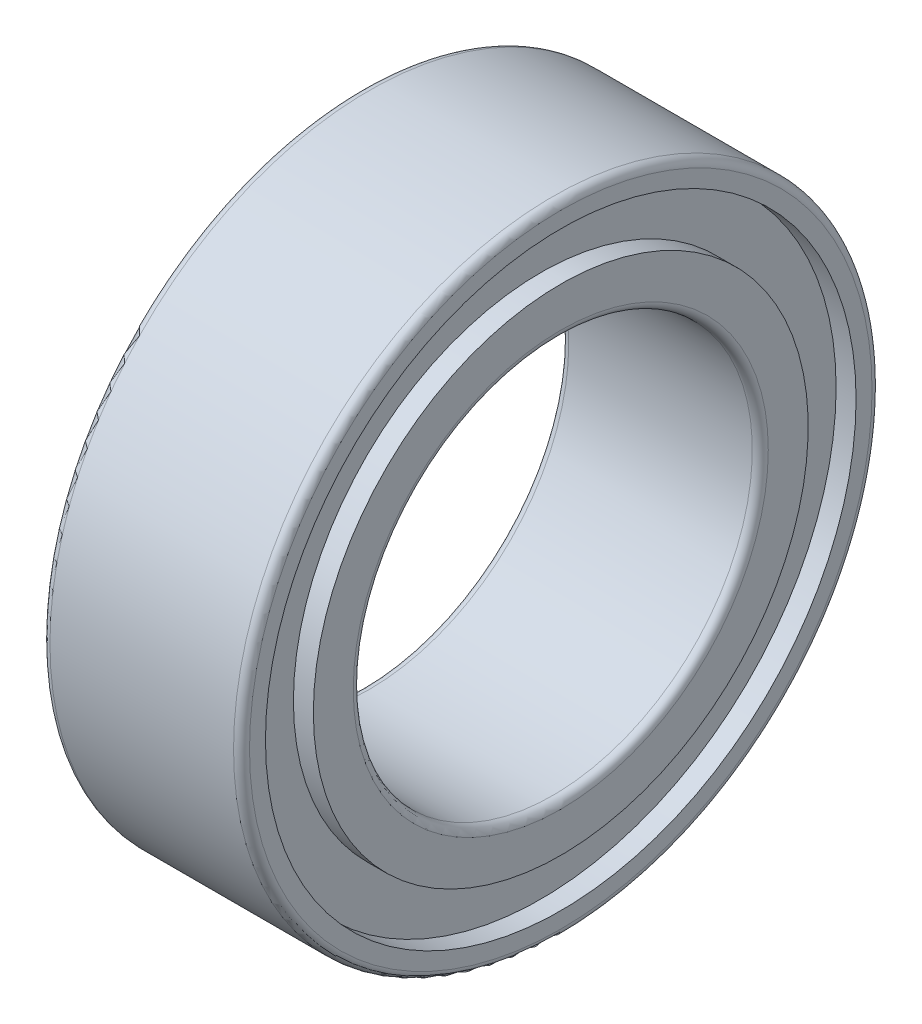
ISO-10303-21;
HEADER;
FILE_DESCRIPTION(('STEP AP214'),'2;1');
FILE_NAME('part.step','',(''),(''),'','','');
FILE_SCHEMA(('AUTOMOTIVE_DESIGN { 1 0 10303 214 1 1 1 1 }'));
ENDSEC;
DATA;
#1=APPLICATION_CONTEXT('core data for automotive mechanical design processes');
#2=APPLICATION_PROTOCOL_DEFINITION('international standard','automotive_design',2000,#1);
#3=PRODUCT_CONTEXT('',#1,'mechanical');
#4=PRODUCT('Part','Part','',(#3));
#5=PRODUCT_RELATED_PRODUCT_CATEGORY('part','',(#4));
#6=PRODUCT_DEFINITION_FORMATION('','',#4);
#7=PRODUCT_DEFINITION_CONTEXT('part definition',#1,'design');
#8=PRODUCT_DEFINITION('design','',#6,#7);
#9=PRODUCT_DEFINITION_SHAPE('','',#8);
#10=(LENGTH_UNIT() NAMED_UNIT(*) SI_UNIT(.MILLI.,.METRE.));
#11=(NAMED_UNIT(*) PLANE_ANGLE_UNIT() SI_UNIT($,.RADIAN.));
#12=(NAMED_UNIT(*) SI_UNIT($,.STERADIAN.) SOLID_ANGLE_UNIT());
#13=UNCERTAINTY_MEASURE_WITH_UNIT(LENGTH_MEASURE(1.E-05),#10,'distance_accuracy_value','');
#14=(GEOMETRIC_REPRESENTATION_CONTEXT(3) GLOBAL_UNCERTAINTY_ASSIGNED_CONTEXT((#13)) GLOBAL_UNIT_ASSIGNED_CONTEXT((#10,
#11,#12)) REPRESENTATION_CONTEXT('',''));
#15=CARTESIAN_POINT('',(0.,0.,0.));
#16=DIRECTION('',(0.,0.,1.));
#17=DIRECTION('',(1.,0.,0.));
#18=AXIS2_PLACEMENT_3D('',#15,#16,#17);
#19=CARTESIAN_POINT('',(0.,0.,0.));
#20=DIRECTION('',(-1.,0.,0.));
#21=DIRECTION('',(0.,0.,1.));
#22=AXIS2_PLACEMENT_3D('',#19,#20,#21);
#23=CYLINDRICAL_SURFACE('',#22,4.);
#24=CARTESIAN_POINT('',(0.1,0.,0.));
#25=DIRECTION('',(1.,0.,0.));
#26=DIRECTION('',(0.,0.,-1.));
#27=AXIS2_PLACEMENT_3D('',#24,#25,#26);
#28=CIRCLE('',#27,4.);
#29=CARTESIAN_POINT('',(0.1,0.,-4.));
#30=VERTEX_POINT('',#29);
#31=EDGE_CURVE('E41',#30,#30,#28,.T.);
#32=ORIENTED_EDGE('',*,*,#31,.T.);
#33=EDGE_LOOP('',(#32));
#34=FACE_BOUND('',#33,.T.);
#35=CARTESIAN_POINT('',(2.4,0.,0.));
#36=DIRECTION('',(-1.,0.,0.));
#37=DIRECTION('',(0.,0.,1.));
#38=AXIS2_PLACEMENT_3D('',#35,#36,#37);
#39=CIRCLE('',#38,4.);
#40=CARTESIAN_POINT('',(2.4,0.,4.));
#41=VERTEX_POINT('',#40);
#42=EDGE_CURVE('E45',#41,#41,#39,.T.);
#43=ORIENTED_EDGE('',*,*,#42,.T.);
#44=EDGE_LOOP('',(#43));
#45=FACE_BOUND('',#44,.T.);
#46=ADVANCED_FACE('F30',(#34,#45),#23,.T.);
#47=CARTESIAN_POINT('',(0.,4.,0.));
#48=DIRECTION('',(1.,0.,0.));
#49=DIRECTION('',(0.,0.,-1.));
#50=AXIS2_PLACEMENT_3D('',#47,#48,#49);
#51=PLANE('',#50);
#52=CARTESIAN_POINT('',(0.,0.,0.));
#53=DIRECTION('',(1.,0.,0.));
#54=DIRECTION('',(0.,0.,-1.));
#55=AXIS2_PLACEMENT_3D('',#52,#53,#54);
#56=CIRCLE('',#55,3.9);
#57=CARTESIAN_POINT('',(0.,0.,-3.9));
#58=VERTEX_POINT('',#57);
#59=EDGE_CURVE('E50',#58,#58,#56,.F.);
#60=ORIENTED_EDGE('',*,*,#59,.T.);
#61=EDGE_LOOP('',(#60));
#62=FACE_BOUND('',#61,.T.);
#63=CARTESIAN_POINT('',(0.,0.,0.));
#64=DIRECTION('',(-1.,0.,0.));
#65=DIRECTION('',(0.,0.,1.));
#66=AXIS2_PLACEMENT_3D('',#63,#64,#65);
#67=CIRCLE('',#66,3.7);
#68=CARTESIAN_POINT('',(0.,0.,3.7));
#69=VERTEX_POINT('',#68);
#70=EDGE_CURVE('E62',#69,#69,#67,.T.);
#71=ORIENTED_EDGE('',*,*,#70,.F.);
#72=EDGE_LOOP('',(#71));
#73=FACE_BOUND('',#72,.T.);
#74=ADVANCED_FACE('F118',(#62,#73),#51,.F.);
#75=CARTESIAN_POINT('',(0.,0.,0.));
#76=DIRECTION('',(-1.,0.,0.));
#77=DIRECTION('',(0.,0.,1.));
#78=AXIS2_PLACEMENT_3D('',#75,#76,#77);
#79=CYLINDRICAL_SURFACE('',#78,3.7);
#80=CARTESIAN_POINT('',(0.25,0.,0.));
#81=DIRECTION('',(-1.,0.,0.));
#82=DIRECTION('',(0.,0.,1.));
#83=AXIS2_PLACEMENT_3D('',#80,#81,#82);
#84=CIRCLE('',#83,3.7);
#85=CARTESIAN_POINT('',(0.25,0.,3.7));
#86=VERTEX_POINT('',#85);
#87=EDGE_CURVE('E65',#86,#86,#84,.T.);
#88=ORIENTED_EDGE('',*,*,#87,.F.);
#89=EDGE_LOOP('',(#88));
#90=FACE_BOUND('',#89,.T.);
#91=ORIENTED_EDGE('',*,*,#70,.T.);
#92=EDGE_LOOP('',(#91));
#93=FACE_BOUND('',#92,.T.);
#94=ADVANCED_FACE('F124',(#90,#93),#79,.F.);
#95=CARTESIAN_POINT('',(0.25,3.7,0.));
#96=DIRECTION('',(1.,0.,0.));
#97=DIRECTION('',(0.,0.,-1.));
#98=AXIS2_PLACEMENT_3D('',#95,#96,#97);
#99=PLANE('',#98);
#100=CARTESIAN_POINT('',(0.25,0.,0.));
#101=DIRECTION('',(-1.,0.,0.));
#102=DIRECTION('',(0.,0.,1.));
#103=AXIS2_PLACEMENT_3D('',#100,#101,#102);
#104=CIRCLE('',#103,3.1);
#105=CARTESIAN_POINT('',(0.25,0.,3.1));
#106=VERTEX_POINT('',#105);
#107=EDGE_CURVE('E68',#106,#106,#104,.T.);
#108=ORIENTED_EDGE('',*,*,#107,.F.);
#109=EDGE_LOOP('',(#108));
#110=FACE_BOUND('',#109,.T.);
#111=ORIENTED_EDGE('',*,*,#87,.T.);
#112=EDGE_LOOP('',(#111));
#113=FACE_BOUND('',#112,.T.);
#114=ADVANCED_FACE('F234',(#110,#113),#99,.F.);
#115=CARTESIAN_POINT('',(0.,0.,0.));
#116=DIRECTION('',(-1.,0.,0.));
#117=DIRECTION('',(0.,0.,1.));
#118=AXIS2_PLACEMENT_3D('',#115,#116,#117);
#119=CYLINDRICAL_SURFACE('',#118,3.1);
#120=CARTESIAN_POINT('',(0.,0.,0.));
#121=DIRECTION('',(-1.,0.,0.));
#122=DIRECTION('',(0.,0.,1.));
#123=AXIS2_PLACEMENT_3D('',#120,#121,#122);
#124=CIRCLE('',#123,3.1);
#125=CARTESIAN_POINT('',(0.,0.,3.1));
#126=VERTEX_POINT('',#125);
#127=EDGE_CURVE('E71',#126,#126,#124,.T.);
#128=ORIENTED_EDGE('',*,*,#127,.F.);
#129=EDGE_LOOP('',(#128));
#130=FACE_BOUND('',#129,.T.);
#131=ORIENTED_EDGE('',*,*,#107,.T.);
#132=EDGE_LOOP('',(#131));
#133=FACE_BOUND('',#132,.T.);
#134=ADVANCED_FACE('F196',(#130,#133),#119,.T.);
#135=CARTESIAN_POINT('',(0.,3.1,0.));
#136=DIRECTION('',(1.,0.,0.));
#137=DIRECTION('',(0.,0.,-1.));
#138=AXIS2_PLACEMENT_3D('',#135,#136,#137);
#139=PLANE('',#138);
#140=CARTESIAN_POINT('',(0.,0.,0.));
#141=DIRECTION('',(1.,0.,0.));
#142=DIRECTION('',(0.,0.,-1.));
#143=AXIS2_PLACEMENT_3D('',#140,#141,#142);
#144=CIRCLE('',#143,2.6);
#145=CARTESIAN_POINT('',(0.,0.,-2.6));
#146=VERTEX_POINT('',#145);
#147=EDGE_CURVE('E53',#146,#146,#144,.T.);
#148=ORIENTED_EDGE('',*,*,#147,.T.);
#149=EDGE_LOOP('',(#148));
#150=FACE_BOUND('',#149,.T.);
#151=ORIENTED_EDGE('',*,*,#127,.T.);
#152=EDGE_LOOP('',(#151));
#153=FACE_BOUND('',#152,.T.);
#154=ADVANCED_FACE('F114',(#150,#153),#139,.F.);
#155=CARTESIAN_POINT('',(0.,0.,0.));
#156=DIRECTION('',(-1.,0.,0.));
#157=DIRECTION('',(0.,0.,1.));
#158=AXIS2_PLACEMENT_3D('',#155,#156,#157);
#159=CYLINDRICAL_SURFACE('',#158,2.5);
#160=CARTESIAN_POINT('',(0.1,0.,0.));
#161=DIRECTION('',(1.,0.,0.));
#162=DIRECTION('',(0.,0.,-1.));
#163=AXIS2_PLACEMENT_3D('',#160,#161,#162);
#164=CIRCLE('',#163,2.5);
#165=CARTESIAN_POINT('',(0.1,0.,-2.5));
#166=VERTEX_POINT('',#165);
#167=EDGE_CURVE('E56',#166,#166,#164,.F.);
#168=ORIENTED_EDGE('',*,*,#167,.T.);
#169=EDGE_LOOP('',(#168));
#170=FACE_BOUND('',#169,.T.);
#171=CARTESIAN_POINT('',(2.4,0.,0.));
#172=DIRECTION('',(-1.,0.,0.));
#173=DIRECTION('',(0.,0.,1.));
#174=AXIS2_PLACEMENT_3D('',#171,#172,#173);
#175=CIRCLE('',#174,2.5);
#176=CARTESIAN_POINT('',(2.4,0.,2.5));
#177=VERTEX_POINT('',#176);
#178=EDGE_CURVE('E59',#177,#177,#175,.F.);
#179=ORIENTED_EDGE('',*,*,#178,.T.);
#180=EDGE_LOOP('',(#179));
#181=FACE_BOUND('',#180,.T.);
#182=ADVANCED_FACE('F109',(#170,#181),#159,.F.);
#183=CARTESIAN_POINT('',(2.5,2.5,0.));
#184=DIRECTION('',(-1.,0.,0.));
#185=DIRECTION('',(0.,0.,1.));
#186=AXIS2_PLACEMENT_3D('',#183,#184,#185);
#187=PLANE('',#186);
#188=CARTESIAN_POINT('',(2.5,0.,0.));
#189=DIRECTION('',(-1.,0.,0.));
#190=DIRECTION('',(0.,0.,1.));
#191=AXIS2_PLACEMENT_3D('',#188,#189,#190);
#192=CIRCLE('',#191,2.6);
#193=CARTESIAN_POINT('',(2.5,0.,2.6));
#194=VERTEX_POINT('',#193);
#195=EDGE_CURVE('E37',#194,#194,#192,.T.);
#196=ORIENTED_EDGE('',*,*,#195,.T.);
#197=EDGE_LOOP('',(#196));
#198=FACE_BOUND('',#197,.T.);
#199=CARTESIAN_POINT('',(2.5,0.,0.));
#200=DIRECTION('',(-1.,0.,0.));
#201=DIRECTION('',(0.,0.,1.));
#202=AXIS2_PLACEMENT_3D('',#199,#200,#201);
#203=CIRCLE('',#202,3.1);
#204=CARTESIAN_POINT('',(2.5,0.,3.1));
#205=VERTEX_POINT('',#204);
#206=EDGE_CURVE('E74',#205,#205,#203,.T.);
#207=ORIENTED_EDGE('',*,*,#206,.F.);
#208=EDGE_LOOP('',(#207));
#209=FACE_BOUND('',#208,.T.);
#210=ADVANCED_FACE('F104',(#198,#209),#187,.F.);
#211=CARTESIAN_POINT('',(0.,0.,0.));
#212=DIRECTION('',(-1.,0.,0.));
#213=DIRECTION('',(0.,0.,1.));
#214=AXIS2_PLACEMENT_3D('',#211,#212,#213);
#215=CYLINDRICAL_SURFACE('',#214,3.1);
#216=CARTESIAN_POINT('',(2.25,0.,0.));
#217=DIRECTION('',(-1.,0.,0.));
#218=DIRECTION('',(0.,0.,1.));
#219=AXIS2_PLACEMENT_3D('',#216,#217,#218);
#220=CIRCLE('',#219,3.1);
#221=CARTESIAN_POINT('',(2.25,0.,3.1));
#222=VERTEX_POINT('',#221);
#223=EDGE_CURVE('E77',#222,#222,#220,.T.);
#224=ORIENTED_EDGE('',*,*,#223,.F.);
#225=EDGE_LOOP('',(#224));
#226=FACE_BOUND('',#225,.T.);
#227=ORIENTED_EDGE('',*,*,#206,.T.);
#228=EDGE_LOOP('',(#227));
#229=FACE_BOUND('',#228,.T.);
#230=ADVANCED_FACE('F98',(#226,#229),#215,.T.);
#231=CARTESIAN_POINT('',(2.25,3.7,0.));
#232=DIRECTION('',(-1.,0.,0.));
#233=DIRECTION('',(0.,0.,1.));
#234=AXIS2_PLACEMENT_3D('',#231,#232,#233);
#235=PLANE('',#234);
#236=CARTESIAN_POINT('',(2.25,0.,0.));
#237=DIRECTION('',(-1.,0.,0.));
#238=DIRECTION('',(0.,0.,1.));
#239=AXIS2_PLACEMENT_3D('',#236,#237,#238);
#240=CIRCLE('',#239,3.7);
#241=CARTESIAN_POINT('',(2.25,0.,3.7));
#242=VERTEX_POINT('',#241);
#243=EDGE_CURVE('E80',#242,#242,#240,.T.);
#244=ORIENTED_EDGE('',*,*,#243,.F.);
#245=EDGE_LOOP('',(#244));
#246=FACE_BOUND('',#245,.T.);
#247=ORIENTED_EDGE('',*,*,#223,.T.);
#248=EDGE_LOOP('',(#247));
#249=FACE_BOUND('',#248,.T.);
#250=ADVANCED_FACE('F92',(#246,#249),#235,.F.);
#251=CARTESIAN_POINT('',(0.,0.,0.));
#252=DIRECTION('',(-1.,0.,0.));
#253=DIRECTION('',(0.,0.,1.));
#254=AXIS2_PLACEMENT_3D('',#251,#252,#253);
#255=CYLINDRICAL_SURFACE('',#254,3.7);
#256=CARTESIAN_POINT('',(2.5,0.,0.));
#257=DIRECTION('',(-1.,0.,0.));
#258=DIRECTION('',(0.,0.,1.));
#259=AXIS2_PLACEMENT_3D('',#256,#257,#258);
#260=CIRCLE('',#259,3.7);
#261=CARTESIAN_POINT('',(2.5,0.,3.7));
#262=VERTEX_POINT('',#261);
#263=EDGE_CURVE('E83',#262,#262,#260,.T.);
#264=ORIENTED_EDGE('',*,*,#263,.F.);
#265=EDGE_LOOP('',(#264));
#266=FACE_BOUND('',#265,.T.);
#267=ORIENTED_EDGE('',*,*,#243,.T.);
#268=EDGE_LOOP('',(#267));
#269=FACE_BOUND('',#268,.T.);
#270=ADVANCED_FACE('F89',(#266,#269),#255,.F.);
#271=CARTESIAN_POINT('',(2.5,3.7,0.));
#272=DIRECTION('',(-1.,0.,0.));
#273=DIRECTION('',(0.,0.,1.));
#274=AXIS2_PLACEMENT_3D('',#271,#272,#273);
#275=PLANE('',#274);
#276=CARTESIAN_POINT('',(2.5,0.,0.));
#277=DIRECTION('',(-1.,0.,0.));
#278=DIRECTION('',(0.,0.,1.));
#279=AXIS2_PLACEMENT_3D('',#276,#277,#278);
#280=CIRCLE('',#279,3.9);
#281=CARTESIAN_POINT('',(2.5,0.,3.9));
#282=VERTEX_POINT('',#281);
#283=EDGE_CURVE('E10',#282,#282,#280,.F.);
#284=ORIENTED_EDGE('',*,*,#283,.T.);
#285=EDGE_LOOP('',(#284));
#286=FACE_BOUND('',#285,.T.);
#287=ORIENTED_EDGE('',*,*,#263,.T.);
#288=EDGE_LOOP('',(#287));
#289=FACE_BOUND('',#288,.T.);
#290=ADVANCED_FACE('F87',(#286,#289),#275,.F.);
#291=CARTESIAN_POINT('',(0.1,0.,0.));
#292=DIRECTION('',(1.,0.,0.));
#293=DIRECTION('',(0.,0.,-1.));
#294=AXIS2_PLACEMENT_3D('',#291,#292,#293);
#295=TOROIDAL_SURFACE('',#294,2.6,0.1);
#296=ORIENTED_EDGE('',*,*,#147,.F.);
#297=EDGE_LOOP('',(#296));
#298=FACE_BOUND('',#297,.T.);
#299=ORIENTED_EDGE('',*,*,#167,.F.);
#300=EDGE_LOOP('',(#299));
#301=FACE_BOUND('',#300,.T.);
#302=ADVANCED_FACE('F130',(#298,#301),#295,.T.);
#303=CARTESIAN_POINT('',(0.1,0.,0.));
#304=DIRECTION('',(1.,0.,0.));
#305=DIRECTION('',(0.,0.,-1.));
#306=AXIS2_PLACEMENT_3D('',#303,#304,#305);
#307=TOROIDAL_SURFACE('',#306,3.9,0.1);
#308=ORIENTED_EDGE('',*,*,#31,.F.);
#309=EDGE_LOOP('',(#308));
#310=FACE_BOUND('',#309,.T.);
#311=ORIENTED_EDGE('',*,*,#59,.F.);
#312=EDGE_LOOP('',(#311));
#313=FACE_BOUND('',#312,.T.);
#314=ADVANCED_FACE('F133',(#310,#313),#307,.T.);
#315=CARTESIAN_POINT('',(2.4,0.,0.));
#316=DIRECTION('',(-1.,0.,0.));
#317=DIRECTION('',(0.,0.,1.));
#318=AXIS2_PLACEMENT_3D('',#315,#316,#317);
#319=TOROIDAL_SURFACE('',#318,2.6,0.1);
#320=ORIENTED_EDGE('',*,*,#178,.F.);
#321=EDGE_LOOP('',(#320));
#322=FACE_BOUND('',#321,.T.);
#323=ORIENTED_EDGE('',*,*,#195,.F.);
#324=EDGE_LOOP('',(#323));
#325=FACE_BOUND('',#324,.T.);
#326=ADVANCED_FACE('F136',(#322,#325),#319,.T.);
#327=CARTESIAN_POINT('',(2.4,0.,0.));
#328=DIRECTION('',(-1.,0.,0.));
#329=DIRECTION('',(0.,0.,1.));
#330=AXIS2_PLACEMENT_3D('',#327,#328,#329);
#331=TOROIDAL_SURFACE('',#330,3.9,0.1);
#332=ORIENTED_EDGE('',*,*,#283,.F.);
#333=EDGE_LOOP('',(#332));
#334=FACE_BOUND('',#333,.T.);
#335=ORIENTED_EDGE('',*,*,#42,.F.);
#336=EDGE_LOOP('',(#335));
#337=FACE_BOUND('',#336,.T.);
#338=ADVANCED_FACE('F32',(#334,#337),#331,.T.);
#339=CLOSED_SHELL('',(#46,#74,#94,#114,#134,#154,#182,#210,#230,#250,#270,#290,#302,#314,#326,#338));
#340=MANIFOLD_SOLID_BREP('B2',#339);
#341=ADVANCED_BREP_SHAPE_REPRESENTATION('',(#18,#340),#14);
#342=SHAPE_DEFINITION_REPRESENTATION(#9,#341);
ENDSEC;
END-ISO-10303-21;
